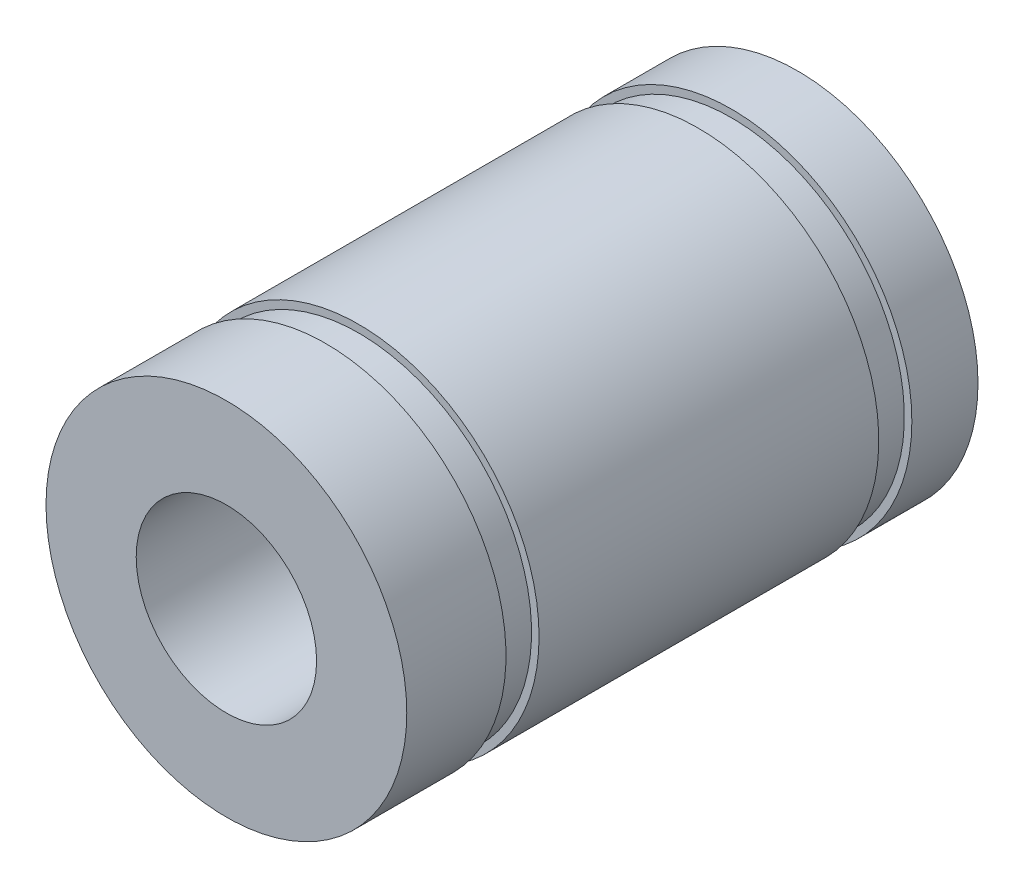
ISO-10303-21;
HEADER;
FILE_DESCRIPTION(('STEP AP214'),'2;1');
FILE_NAME('part.step','',(''),(''),'','','');
FILE_SCHEMA(('AUTOMOTIVE_DESIGN { 1 0 10303 214 1 1 1 1 }'));
ENDSEC;
DATA;
#1=APPLICATION_CONTEXT('core data for automotive mechanical design processes');
#2=APPLICATION_PROTOCOL_DEFINITION('international standard','automotive_design',2000,#1);
#3=PRODUCT_CONTEXT('',#1,'mechanical');
#4=PRODUCT('Part','Part','',(#3));
#5=PRODUCT_RELATED_PRODUCT_CATEGORY('part','',(#4));
#6=PRODUCT_DEFINITION_FORMATION('','',#4);
#7=PRODUCT_DEFINITION_CONTEXT('part definition',#1,'design');
#8=PRODUCT_DEFINITION('design','',#6,#7);
#9=PRODUCT_DEFINITION_SHAPE('','',#8);
#10=(LENGTH_UNIT() NAMED_UNIT(*) SI_UNIT(.MILLI.,.METRE.));
#11=(NAMED_UNIT(*) PLANE_ANGLE_UNIT() SI_UNIT($,.RADIAN.));
#12=(NAMED_UNIT(*) SI_UNIT($,.STERADIAN.) SOLID_ANGLE_UNIT());
#13=UNCERTAINTY_MEASURE_WITH_UNIT(LENGTH_MEASURE(1.E-05),#10,'distance_accuracy_value','');
#14=(GEOMETRIC_REPRESENTATION_CONTEXT(3) GLOBAL_UNCERTAINTY_ASSIGNED_CONTEXT((#13)) GLOBAL_UNIT_ASSIGNED_CONTEXT((#10,
#11,#12)) REPRESENTATION_CONTEXT('',''));
#15=CARTESIAN_POINT('',(0.,0.,0.));
#16=DIRECTION('',(0.,0.,1.));
#17=DIRECTION('',(1.,0.,0.));
#18=AXIS2_PLACEMENT_3D('',#15,#16,#17);
#19=CARTESIAN_POINT('',(0.,0.,19.));
#20=DIRECTION('',(0.,0.,-1.));
#21=DIRECTION('',(-1.,0.,0.));
#22=AXIS2_PLACEMENT_3D('',#19,#20,#21);
#23=CYLINDRICAL_SURFACE('',#22,6.);
#24=CARTESIAN_POINT('',(0.,0.,3.3));
#25=DIRECTION('',(0.,0.,-1.));
#26=DIRECTION('',(-1.,0.,0.));
#27=AXIS2_PLACEMENT_3D('',#24,#25,#26);
#28=CIRCLE('',#27,6.);
#29=CARTESIAN_POINT('',(-6.,0.,3.3));
#30=VERTEX_POINT('',#29);
#31=EDGE_CURVE('E51',#30,#30,#28,.T.);
#32=ORIENTED_EDGE('',*,*,#31,.F.);
#33=EDGE_LOOP('',(#32));
#34=FACE_BOUND('',#33,.T.);
#35=CARTESIAN_POINT('',(0.,0.,14.6));
#36=DIRECTION('',(0.,0.,1.));
#37=DIRECTION('',(1.,0.,0.));
#38=AXIS2_PLACEMENT_3D('',#35,#36,#37);
#39=CIRCLE('',#38,6.);
#40=CARTESIAN_POINT('',(6.,0.,14.6));
#41=VERTEX_POINT('',#40);
#42=EDGE_CURVE('E33',#41,#41,#39,.T.);
#43=ORIENTED_EDGE('',*,*,#42,.F.);
#44=EDGE_LOOP('',(#43));
#45=FACE_BOUND('',#44,.T.);
#46=ADVANCED_FACE('F30',(#34,#45),#23,.T.);
#47=CARTESIAN_POINT('',(0.,0.,19.));
#48=DIRECTION('',(0.,0.,1.));
#49=DIRECTION('',(1.,0.,0.));
#50=AXIS2_PLACEMENT_3D('',#47,#48,#49);
#51=CIRCLE('',#50,6.);
#52=CARTESIAN_POINT('',(6.,0.,19.));
#53=VERTEX_POINT('',#52);
#54=EDGE_CURVE('E10',#53,#53,#51,.T.);
#55=ORIENTED_EDGE('',*,*,#54,.F.);
#56=EDGE_LOOP('',(#55));
#57=FACE_BOUND('',#56,.T.);
#58=CARTESIAN_POINT('',(0.,0.,15.7));
#59=DIRECTION('',(0.,0.,-1.));
#60=DIRECTION('',(-1.,0.,0.));
#61=AXIS2_PLACEMENT_3D('',#58,#59,#60);
#62=CIRCLE('',#61,6.);
#63=CARTESIAN_POINT('',(-6.,0.,15.7));
#64=VERTEX_POINT('',#63);
#65=EDGE_CURVE('E54',#64,#64,#62,.T.);
#66=ORIENTED_EDGE('',*,*,#65,.F.);
#67=EDGE_LOOP('',(#66));
#68=FACE_BOUND('',#67,.T.);
#69=ADVANCED_FACE('F97',(#57,#68),#23,.T.);
#70=CARTESIAN_POINT('',(0.,0.,0.));
#71=DIRECTION('',(0.,0.,1.));
#72=DIRECTION('',(1.,0.,0.));
#73=AXIS2_PLACEMENT_3D('',#70,#71,#72);
#74=CIRCLE('',#73,6.);
#75=CARTESIAN_POINT('',(6.,0.,0.));
#76=VERTEX_POINT('',#75);
#77=EDGE_CURVE('E37',#76,#76,#74,.T.);
#78=ORIENTED_EDGE('',*,*,#77,.T.);
#79=EDGE_LOOP('',(#78));
#80=FACE_BOUND('',#79,.T.);
#81=CARTESIAN_POINT('',(0.,0.,2.2));
#82=DIRECTION('',(0.,0.,1.));
#83=DIRECTION('',(1.,0.,0.));
#84=AXIS2_PLACEMENT_3D('',#81,#82,#83);
#85=CIRCLE('',#84,6.);
#86=CARTESIAN_POINT('',(6.,0.,2.2));
#87=VERTEX_POINT('',#86);
#88=EDGE_CURVE('E48',#87,#87,#85,.T.);
#89=ORIENTED_EDGE('',*,*,#88,.F.);
#90=EDGE_LOOP('',(#89));
#91=FACE_BOUND('',#90,.T.);
#92=ADVANCED_FACE('F99',(#80,#91),#23,.T.);
#93=CARTESIAN_POINT('',(0.,0.,19.));
#94=DIRECTION('',(0.,0.,1.));
#95=DIRECTION('',(1.,0.,0.));
#96=AXIS2_PLACEMENT_3D('',#93,#94,#95);
#97=PLANE('',#96);
#98=ORIENTED_EDGE('',*,*,#54,.T.);
#99=EDGE_LOOP('',(#98));
#100=FACE_BOUND('',#99,.T.);
#101=CARTESIAN_POINT('',(0.,0.,19.));
#102=DIRECTION('',(0.,0.,1.));
#103=DIRECTION('',(1.,0.,0.));
#104=AXIS2_PLACEMENT_3D('',#101,#102,#103);
#105=CIRCLE('',#104,3.);
#106=CARTESIAN_POINT('',(3.,0.,19.));
#107=VERTEX_POINT('',#106);
#108=EDGE_CURVE('E42',#107,#107,#105,.T.);
#109=ORIENTED_EDGE('',*,*,#108,.F.);
#110=EDGE_LOOP('',(#109));
#111=FACE_BOUND('',#110,.T.);
#112=ADVANCED_FACE('F92',(#100,#111),#97,.T.);
#113=CARTESIAN_POINT('',(0.,0.,0.));
#114=DIRECTION('',(0.,0.,1.));
#115=DIRECTION('',(1.,0.,0.));
#116=AXIS2_PLACEMENT_3D('',#113,#114,#115);
#117=PLANE('',#116);
#118=ORIENTED_EDGE('',*,*,#77,.F.);
#119=EDGE_LOOP('',(#118));
#120=FACE_BOUND('',#119,.T.);
#121=CARTESIAN_POINT('',(0.,0.,0.));
#122=DIRECTION('',(0.,0.,1.));
#123=DIRECTION('',(1.,0.,0.));
#124=AXIS2_PLACEMENT_3D('',#121,#122,#123);
#125=CIRCLE('',#124,3.);
#126=CARTESIAN_POINT('',(3.,0.,0.));
#127=VERTEX_POINT('',#126);
#128=EDGE_CURVE('E45',#127,#127,#125,.T.);
#129=ORIENTED_EDGE('',*,*,#128,.T.);
#130=EDGE_LOOP('',(#129));
#131=FACE_BOUND('',#130,.T.);
#132=ADVANCED_FACE('F78',(#120,#131),#117,.F.);
#133=CARTESIAN_POINT('',(0.,0.,19.));
#134=DIRECTION('',(0.,0.,-1.));
#135=DIRECTION('',(-1.,0.,0.));
#136=AXIS2_PLACEMENT_3D('',#133,#134,#135);
#137=CYLINDRICAL_SURFACE('',#136,3.);
#138=ORIENTED_EDGE('',*,*,#108,.T.);
#139=EDGE_LOOP('',(#138));
#140=FACE_BOUND('',#139,.T.);
#141=ORIENTED_EDGE('',*,*,#128,.F.);
#142=EDGE_LOOP('',(#141));
#143=FACE_BOUND('',#142,.T.);
#144=ADVANCED_FACE('F80',(#140,#143),#137,.F.);
#145=CARTESIAN_POINT('',(5.75,0.,3.3));
#146=DIRECTION('',(0.,0.,-1.));
#147=DIRECTION('',(-1.,0.,0.));
#148=AXIS2_PLACEMENT_3D('',#145,#146,#147);
#149=PLANE('',#148);
#150=CARTESIAN_POINT('',(0.,0.,3.3));
#151=DIRECTION('',(0.,0.,-1.));
#152=DIRECTION('',(-1.,0.,0.));
#153=AXIS2_PLACEMENT_3D('',#150,#151,#152);
#154=CIRCLE('',#153,5.75);
#155=CARTESIAN_POINT('',(-5.75,0.,3.3));
#156=VERTEX_POINT('',#155);
#157=EDGE_CURVE('E52',#156,#156,#154,.T.);
#158=ORIENTED_EDGE('',*,*,#157,.F.);
#159=EDGE_LOOP('',(#158));
#160=FACE_BOUND('',#159,.T.);
#161=ORIENTED_EDGE('',*,*,#31,.T.);
#162=EDGE_LOOP('',(#161));
#163=FACE_BOUND('',#162,.T.);
#164=ADVANCED_FACE('F82',(#160,#163),#149,.T.);
#165=CARTESIAN_POINT('',(5.75,0.,2.2));
#166=DIRECTION('',(0.,0.,1.));
#167=DIRECTION('',(1.,0.,0.));
#168=AXIS2_PLACEMENT_3D('',#165,#166,#167);
#169=PLANE('',#168);
#170=CARTESIAN_POINT('',(0.,0.,2.2));
#171=DIRECTION('',(0.,0.,-1.));
#172=DIRECTION('',(-1.,0.,0.));
#173=AXIS2_PLACEMENT_3D('',#170,#171,#172);
#174=CIRCLE('',#173,5.75);
#175=CARTESIAN_POINT('',(-5.75,0.,2.2));
#176=VERTEX_POINT('',#175);
#177=EDGE_CURVE('E60',#176,#176,#174,.T.);
#178=ORIENTED_EDGE('',*,*,#177,.T.);
#179=EDGE_LOOP('',(#178));
#180=FACE_BOUND('',#179,.T.);
#181=ORIENTED_EDGE('',*,*,#88,.T.);
#182=EDGE_LOOP('',(#181));
#183=FACE_BOUND('',#182,.T.);
#184=ADVANCED_FACE('F89',(#180,#183),#169,.T.);
#185=CARTESIAN_POINT('',(0.,0.,0.));
#186=DIRECTION('',(0.,0.,-1.));
#187=DIRECTION('',(-1.,0.,0.));
#188=AXIS2_PLACEMENT_3D('',#185,#186,#187);
#189=CYLINDRICAL_SURFACE('',#188,5.75);
#190=ORIENTED_EDGE('',*,*,#157,.T.);
#191=EDGE_LOOP('',(#190));
#192=FACE_BOUND('',#191,.T.);
#193=ORIENTED_EDGE('',*,*,#177,.F.);
#194=EDGE_LOOP('',(#193));
#195=FACE_BOUND('',#194,.T.);
#196=ADVANCED_FACE('F117',(#192,#195),#189,.T.);
#197=CARTESIAN_POINT('',(5.75,0.,14.6));
#198=DIRECTION('',(0.,0.,1.));
#199=DIRECTION('',(1.,0.,0.));
#200=AXIS2_PLACEMENT_3D('',#197,#198,#199);
#201=PLANE('',#200);
#202=CARTESIAN_POINT('',(0.,0.,14.6));
#203=DIRECTION('',(0.,0.,-1.));
#204=DIRECTION('',(-1.,0.,0.));
#205=AXIS2_PLACEMENT_3D('',#202,#203,#204);
#206=CIRCLE('',#205,5.75);
#207=CARTESIAN_POINT('',(-5.75000000000001,0.,14.6));
#208=VERTEX_POINT('',#207);
#209=EDGE_CURVE('E56',#208,#208,#206,.T.);
#210=ORIENTED_EDGE('',*,*,#209,.T.);
#211=EDGE_LOOP('',(#210));
#212=FACE_BOUND('',#211,.T.);
#213=ORIENTED_EDGE('',*,*,#42,.T.);
#214=EDGE_LOOP('',(#213));
#215=FACE_BOUND('',#214,.T.);
#216=ADVANCED_FACE('F123',(#212,#215),#201,.T.);
#217=CARTESIAN_POINT('',(5.75,0.,15.7));
#218=DIRECTION('',(0.,0.,-1.));
#219=DIRECTION('',(-1.,0.,0.));
#220=AXIS2_PLACEMENT_3D('',#217,#218,#219);
#221=PLANE('',#220);
#222=CARTESIAN_POINT('',(0.,0.,15.7));
#223=DIRECTION('',(0.,0.,-1.));
#224=DIRECTION('',(-1.,0.,0.));
#225=AXIS2_PLACEMENT_3D('',#222,#223,#224);
#226=CIRCLE('',#225,5.75000000000001);
#227=CARTESIAN_POINT('',(-5.75000000000001,0.,15.7));
#228=VERTEX_POINT('',#227);
#229=EDGE_CURVE('E62',#228,#228,#226,.T.);
#230=ORIENTED_EDGE('',*,*,#229,.F.);
#231=EDGE_LOOP('',(#230));
#232=FACE_BOUND('',#231,.T.);
#233=ORIENTED_EDGE('',*,*,#65,.T.);
#234=EDGE_LOOP('',(#233));
#235=FACE_BOUND('',#234,.T.);
#236=ADVANCED_FACE('F129',(#232,#235),#221,.T.);
#237=CARTESIAN_POINT('',(0.,0.,0.));
#238=DIRECTION('',(0.,0.,-1.));
#239=DIRECTION('',(-1.,0.,0.));
#240=AXIS2_PLACEMENT_3D('',#237,#238,#239);
#241=CYLINDRICAL_SURFACE('',#240,5.75000000000001);
#242=ORIENTED_EDGE('',*,*,#229,.T.);
#243=EDGE_LOOP('',(#242));
#244=FACE_BOUND('',#243,.T.);
#245=ORIENTED_EDGE('',*,*,#209,.F.);
#246=EDGE_LOOP('',(#245));
#247=FACE_BOUND('',#246,.T.);
#248=ADVANCED_FACE('F126',(#244,#247),#241,.T.);
#249=CLOSED_SHELL('',(#46,#69,#92,#112,#132,#144,#164,#184,#196,#216,#236,#248));
#250=MANIFOLD_SOLID_BREP('B2',#249);
#251=ADVANCED_BREP_SHAPE_REPRESENTATION('',(#18,#250),#14);
#252=SHAPE_DEFINITION_REPRESENTATION(#9,#251);
ENDSEC;
END-ISO-10303-21;
